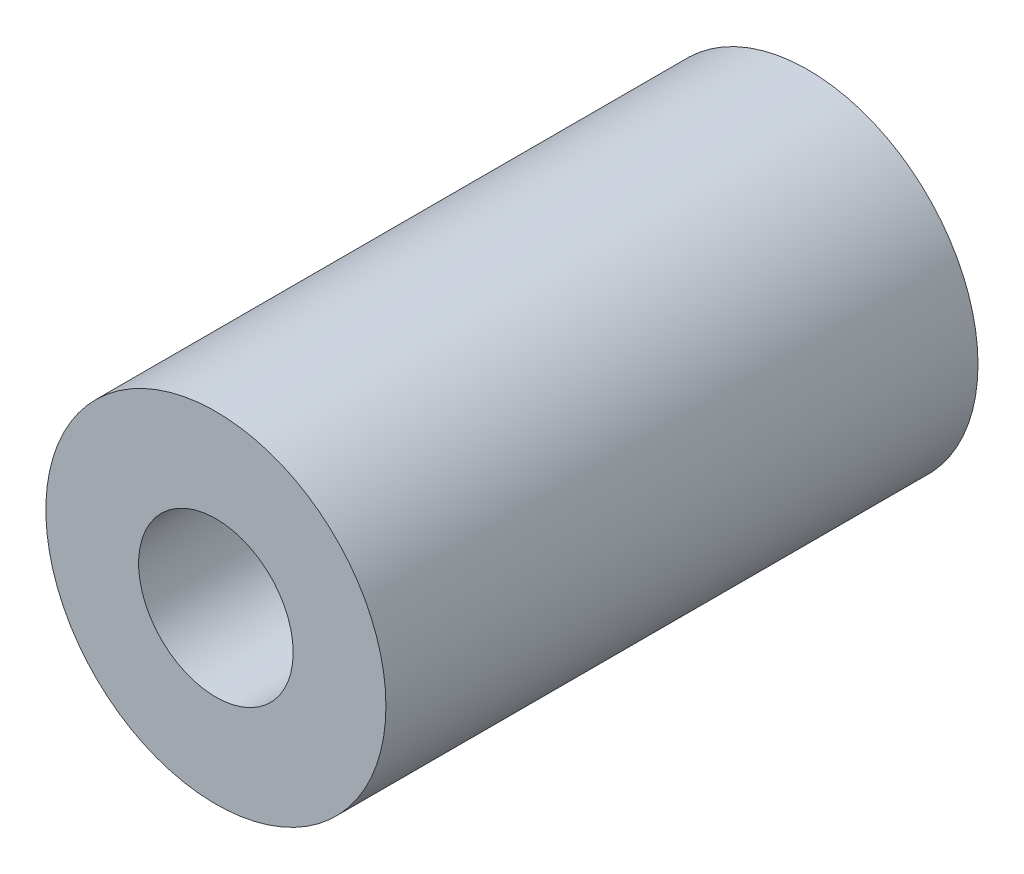
ISO-10303-21;
HEADER;
FILE_DESCRIPTION(('STEP AP214'),'2;1');
FILE_NAME('part.step','',(''),(''),'','','');
FILE_SCHEMA(('AUTOMOTIVE_DESIGN { 1 0 10303 214 1 1 1 1 }'));
ENDSEC;
DATA;
#1=APPLICATION_CONTEXT('core data for automotive mechanical design processes');
#2=APPLICATION_PROTOCOL_DEFINITION('international standard','automotive_design',2000,#1);
#3=PRODUCT_CONTEXT('',#1,'mechanical');
#4=PRODUCT('Part','Part','',(#3));
#5=PRODUCT_RELATED_PRODUCT_CATEGORY('part','',(#4));
#6=PRODUCT_DEFINITION_FORMATION('','',#4);
#7=PRODUCT_DEFINITION_CONTEXT('part definition',#1,'design');
#8=PRODUCT_DEFINITION('design','',#6,#7);
#9=PRODUCT_DEFINITION_SHAPE('','',#8);
#10=(LENGTH_UNIT() NAMED_UNIT(*) SI_UNIT(.MILLI.,.METRE.));
#11=(NAMED_UNIT(*) PLANE_ANGLE_UNIT() SI_UNIT($,.RADIAN.));
#12=(NAMED_UNIT(*) SI_UNIT($,.STERADIAN.) SOLID_ANGLE_UNIT());
#13=UNCERTAINTY_MEASURE_WITH_UNIT(LENGTH_MEASURE(1.E-05),#10,'distance_accuracy_value','');
#14=(GEOMETRIC_REPRESENTATION_CONTEXT(3) GLOBAL_UNCERTAINTY_ASSIGNED_CONTEXT((#13)) GLOBAL_UNIT_ASSIGNED_CONTEXT((#10,
#11,#12)) REPRESENTATION_CONTEXT('',''));
#15=CARTESIAN_POINT('',(0.,0.,0.));
#16=DIRECTION('',(0.,0.,1.));
#17=DIRECTION('',(1.,0.,0.));
#18=AXIS2_PLACEMENT_3D('',#15,#16,#17);
#19=CARTESIAN_POINT('',(0.,0.,19.15));
#20=DIRECTION('',(0.,0.,1.));
#21=DIRECTION('',(1.,0.,0.));
#22=AXIS2_PLACEMENT_3D('',#19,#20,#21);
#23=PLANE('',#22);
#24=CARTESIAN_POINT('',(0.,0.,19.15));
#25=DIRECTION('',(0.,0.,1.));
#26=DIRECTION('',(1.,0.,0.));
#27=AXIS2_PLACEMENT_3D('',#24,#25,#26);
#28=CIRCLE('',#27,5.5);
#29=CARTESIAN_POINT('',(5.5,0.,19.15));
#30=VERTEX_POINT('',#29);
#31=EDGE_CURVE('E10',#30,#30,#28,.T.);
#32=ORIENTED_EDGE('',*,*,#31,.T.);
#33=EDGE_LOOP('',(#32));
#34=FACE_BOUND('',#33,.T.);
#35=CARTESIAN_POINT('',(0.,0.,19.15));
#36=DIRECTION('',(0.,0.,1.));
#37=DIRECTION('',(1.,0.,0.));
#38=AXIS2_PLACEMENT_3D('',#35,#36,#37);
#39=CIRCLE('',#38,2.5);
#40=CARTESIAN_POINT('',(2.5,0.,19.15));
#41=VERTEX_POINT('',#40);
#42=EDGE_CURVE('E46',#41,#41,#39,.T.);
#43=ORIENTED_EDGE('',*,*,#42,.F.);
#44=EDGE_LOOP('',(#43));
#45=FACE_BOUND('',#44,.T.);
#46=ADVANCED_FACE('F35',(#34,#45),#23,.T.);
#47=CARTESIAN_POINT('',(0.,0.,0.));
#48=DIRECTION('',(0.,0.,1.));
#49=DIRECTION('',(1.,0.,0.));
#50=AXIS2_PLACEMENT_3D('',#47,#48,#49);
#51=PLANE('',#50);
#52=CARTESIAN_POINT('',(0.,0.,0.));
#53=DIRECTION('',(0.,0.,1.));
#54=DIRECTION('',(1.,0.,0.));
#55=AXIS2_PLACEMENT_3D('',#52,#53,#54);
#56=CIRCLE('',#55,5.5);
#57=CARTESIAN_POINT('',(5.5,0.,0.));
#58=VERTEX_POINT('',#57);
#59=EDGE_CURVE('E39',#58,#58,#56,.T.);
#60=ORIENTED_EDGE('',*,*,#59,.F.);
#61=EDGE_LOOP('',(#60));
#62=FACE_BOUND('',#61,.T.);
#63=CARTESIAN_POINT('',(0.,0.,0.));
#64=DIRECTION('',(0.,0.,1.));
#65=DIRECTION('',(1.,0.,0.));
#66=AXIS2_PLACEMENT_3D('',#63,#64,#65);
#67=CIRCLE('',#66,2.5);
#68=CARTESIAN_POINT('',(2.5,0.,0.));
#69=VERTEX_POINT('',#68);
#70=EDGE_CURVE('E48',#69,#69,#67,.T.);
#71=ORIENTED_EDGE('',*,*,#70,.T.);
#72=EDGE_LOOP('',(#71));
#73=FACE_BOUND('',#72,.T.);
#74=ADVANCED_FACE('F58',(#62,#73),#51,.F.);
#75=CARTESIAN_POINT('',(0.,0.,19.15));
#76=DIRECTION('',(0.,0.,-1.));
#77=DIRECTION('',(-1.,0.,0.));
#78=AXIS2_PLACEMENT_3D('',#75,#76,#77);
#79=CYLINDRICAL_SURFACE('',#78,5.5);
#80=ORIENTED_EDGE('',*,*,#31,.F.);
#81=EDGE_LOOP('',(#80));
#82=FACE_BOUND('',#81,.T.);
#83=ORIENTED_EDGE('',*,*,#59,.T.);
#84=EDGE_LOOP('',(#83));
#85=FACE_BOUND('',#84,.T.);
#86=ADVANCED_FACE('F37',(#82,#85),#79,.T.);
#87=CARTESIAN_POINT('',(0.,0.,19.15));
#88=DIRECTION('',(0.,0.,-1.));
#89=DIRECTION('',(-1.,0.,0.));
#90=AXIS2_PLACEMENT_3D('',#87,#88,#89);
#91=CYLINDRICAL_SURFACE('',#90,2.5);
#92=ORIENTED_EDGE('',*,*,#42,.T.);
#93=EDGE_LOOP('',(#92));
#94=FACE_BOUND('',#93,.T.);
#95=ORIENTED_EDGE('',*,*,#70,.F.);
#96=EDGE_LOOP('',(#95));
#97=FACE_BOUND('',#96,.T.);
#98=ADVANCED_FACE('F54',(#94,#97),#91,.F.);
#99=CLOSED_SHELL('',(#46,#74,#86,#98));
#100=MANIFOLD_SOLID_BREP('B2',#99);
#101=ADVANCED_BREP_SHAPE_REPRESENTATION('',(#18,#100),#14);
#102=SHAPE_DEFINITION_REPRESENTATION(#9,#101);
ENDSEC;
END-ISO-10303-21;
